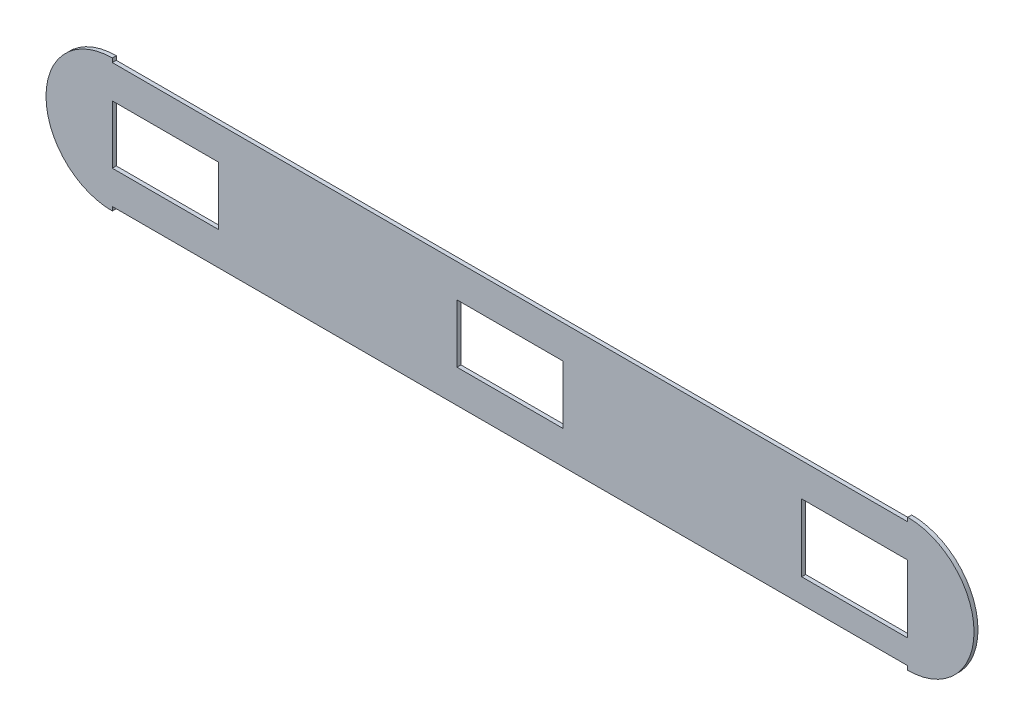
ISO-10303-21;
HEADER;
FILE_DESCRIPTION(('STEP AP214'),'2;1');
FILE_NAME('part.step','',(''),(''),'','','');
FILE_SCHEMA(('AUTOMOTIVE_DESIGN { 1 0 10303 214 1 1 1 1 }'));
ENDSEC;
DATA;
#1=APPLICATION_CONTEXT('core data for automotive mechanical design processes');
#2=APPLICATION_PROTOCOL_DEFINITION('international standard','automotive_design',2000,#1);
#3=PRODUCT_CONTEXT('',#1,'mechanical');
#4=PRODUCT('Part','Part','',(#3));
#5=PRODUCT_RELATED_PRODUCT_CATEGORY('part','',(#4));
#6=PRODUCT_DEFINITION_FORMATION('','',#4);
#7=PRODUCT_DEFINITION_CONTEXT('part definition',#1,'design');
#8=PRODUCT_DEFINITION('design','',#6,#7);
#9=PRODUCT_DEFINITION_SHAPE('','',#8);
#10=(LENGTH_UNIT() NAMED_UNIT(*) SI_UNIT(.MILLI.,.METRE.));
#11=(NAMED_UNIT(*) PLANE_ANGLE_UNIT() SI_UNIT($,.RADIAN.));
#12=(NAMED_UNIT(*) SI_UNIT($,.STERADIAN.) SOLID_ANGLE_UNIT());
#13=UNCERTAINTY_MEASURE_WITH_UNIT(LENGTH_MEASURE(1.E-05),#10,'distance_accuracy_value','');
#14=(GEOMETRIC_REPRESENTATION_CONTEXT(3) GLOBAL_UNCERTAINTY_ASSIGNED_CONTEXT((#13)) GLOBAL_UNIT_ASSIGNED_CONTEXT((#10,
#11,#12)) REPRESENTATION_CONTEXT('',''));
#15=CARTESIAN_POINT('',(0.,0.,0.));
#16=DIRECTION('',(0.,0.,1.));
#17=DIRECTION('',(1.,0.,0.));
#18=AXIS2_PLACEMENT_3D('',#15,#16,#17);
#19=CARTESIAN_POINT('',(-300.,0.,0.));
#20=DIRECTION('',(0.,0.,1.));
#21=DIRECTION('',(1.,0.,0.));
#22=AXIS2_PLACEMENT_3D('',#19,#20,#21);
#23=PLANE('',#22);
#24=DIRECTION('',(1.,0.,0.));
#25=VECTOR('',#24,1.);
#26=CARTESIAN_POINT('',(-300.,-28.9008568911611,0.));
#27=LINE('',#26,#25);
#28=CARTESIAN_POINT('',(220.,-28.900856891161,0.));
#29=VERTEX_POINT('',#28);
#30=CARTESIAN_POINT('',(300.,-28.900856891161,0.));
#31=VERTEX_POINT('',#30);
#32=EDGE_CURVE('E210',#29,#31,#27,.T.);
#33=ORIENTED_EDGE('',*,*,#32,.T.);
#34=DIRECTION('',(0.,1.,0.));
#35=VECTOR('',#34,1.);
#36=CARTESIAN_POINT('',(300.,0.,0.));
#37=LINE('',#36,#35);
#38=CARTESIAN_POINT('',(300.,22.,0.));
#39=VERTEX_POINT('',#38);
#40=EDGE_CURVE('E219',#31,#39,#37,.T.);
#41=ORIENTED_EDGE('',*,*,#40,.T.);
#42=DIRECTION('',(-1.,0.,0.));
#43=VECTOR('',#42,1.);
#44=CARTESIAN_POINT('',(-300.,22.,0.));
#45=LINE('',#44,#43);
#46=CARTESIAN_POINT('',(220.,22.,0.));
#47=VERTEX_POINT('',#46);
#48=EDGE_CURVE('E216',#39,#47,#45,.T.);
#49=ORIENTED_EDGE('',*,*,#48,.T.);
#50=DIRECTION('',(0.,-1.,0.));
#51=VECTOR('',#50,1.);
#52=CARTESIAN_POINT('',(220.,0.,0.));
#53=LINE('',#52,#51);
#54=EDGE_CURVE('E213',#47,#29,#53,.T.);
#55=ORIENTED_EDGE('',*,*,#54,.T.);
#56=EDGE_LOOP('',(#33,#41,#49,#55));
#57=FACE_BOUND('',#56,.T.);
#58=DIRECTION('',(-1.,0.,0.));
#59=VECTOR('',#58,1.);
#60=CARTESIAN_POINT('',(-300.,22.,0.));
#61=LINE('',#60,#59);
#62=CARTESIAN_POINT('',(-220.,22.,0.));
#63=VERTEX_POINT('',#62);
#64=CARTESIAN_POINT('',(-300.,22.,0.));
#65=VERTEX_POINT('',#64);
#66=EDGE_CURVE('E198',#63,#65,#61,.T.);
#67=ORIENTED_EDGE('',*,*,#66,.T.);
#68=DIRECTION('',(0.,-1.,0.));
#69=VECTOR('',#68,1.);
#70=CARTESIAN_POINT('',(-300.,0.,0.));
#71=LINE('',#70,#69);
#72=CARTESIAN_POINT('',(-300.,-22.,0.));
#73=VERTEX_POINT('',#72);
#74=EDGE_CURVE('E207',#65,#73,#71,.T.);
#75=ORIENTED_EDGE('',*,*,#74,.T.);
#76=DIRECTION('',(1.,0.,0.));
#77=VECTOR('',#76,1.);
#78=CARTESIAN_POINT('',(-300.,-22.,0.));
#79=LINE('',#78,#77);
#80=CARTESIAN_POINT('',(-220.,-22.0000000000001,0.));
#81=VERTEX_POINT('',#80);
#82=EDGE_CURVE('E204',#73,#81,#79,.T.);
#83=ORIENTED_EDGE('',*,*,#82,.T.);
#84=DIRECTION('',(0.,1.,0.));
#85=VECTOR('',#84,1.);
#86=CARTESIAN_POINT('',(-220.,0.,0.));
#87=LINE('',#86,#85);
#88=EDGE_CURVE('E201',#81,#63,#87,.T.);
#89=ORIENTED_EDGE('',*,*,#88,.T.);
#90=EDGE_LOOP('',(#67,#75,#83,#89));
#91=FACE_BOUND('',#90,.T.);
#92=DIRECTION('',(1.,0.,0.));
#93=VECTOR('',#92,1.);
#94=CARTESIAN_POINT('',(-300.,-22.,0.));
#95=LINE('',#94,#93);
#96=CARTESIAN_POINT('',(-40.0000000000001,-22.,0.));
#97=VERTEX_POINT('',#96);
#98=CARTESIAN_POINT('',(39.9999999999999,-22.,0.));
#99=VERTEX_POINT('',#98);
#100=EDGE_CURVE('E166',#97,#99,#95,.T.);
#101=ORIENTED_EDGE('',*,*,#100,.T.);
#102=DIRECTION('',(0.,1.,0.));
#103=VECTOR('',#102,1.);
#104=CARTESIAN_POINT('',(39.9999999999999,0.,0.));
#105=LINE('',#104,#103);
#106=CARTESIAN_POINT('',(39.9999999999999,22.,0.));
#107=VERTEX_POINT('',#106);
#108=EDGE_CURVE('E193',#99,#107,#105,.T.);
#109=ORIENTED_EDGE('',*,*,#108,.T.);
#110=DIRECTION('',(-1.,0.,0.));
#111=VECTOR('',#110,1.);
#112=CARTESIAN_POINT('',(-300.,22.,0.));
#113=LINE('',#112,#111);
#114=CARTESIAN_POINT('',(-40.0000000000001,22.,0.));
#115=VERTEX_POINT('',#114);
#116=EDGE_CURVE('E191',#107,#115,#113,.T.);
#117=ORIENTED_EDGE('',*,*,#116,.T.);
#118=DIRECTION('',(0.,-1.,0.));
#119=VECTOR('',#118,1.);
#120=CARTESIAN_POINT('',(-40.0000000000001,0.,0.));
#121=LINE('',#120,#119);
#122=EDGE_CURVE('E177',#115,#97,#121,.T.);
#123=ORIENTED_EDGE('',*,*,#122,.T.);
#124=EDGE_LOOP('',(#101,#109,#117,#123));
#125=FACE_BOUND('',#124,.T.);
#126=DIRECTION('',(1.,0.,0.));
#127=VECTOR('',#126,1.);
#128=CARTESIAN_POINT('',(-300.,47.,0.));
#129=LINE('',#128,#127);
#130=CARTESIAN_POINT('',(-300.,47.,0.));
#131=VERTEX_POINT('',#130);
#132=CARTESIAN_POINT('',(300.,47.,0.));
#133=VERTEX_POINT('',#132);
#134=EDGE_CURVE('E265',#131,#133,#129,.T.);
#135=ORIENTED_EDGE('',*,*,#134,.T.);
#136=DIRECTION('',(0.,-1.,0.));
#137=VECTOR('',#136,1.);
#138=CARTESIAN_POINT('',(300.,3.43367945760358E-13,0.));
#139=LINE('',#138,#137);
#140=CARTESIAN_POINT('',(300.,50.,0.));
#141=VERTEX_POINT('',#140);
#142=EDGE_CURVE('E225',#141,#133,#139,.T.);
#143=ORIENTED_EDGE('',*,*,#142,.F.);
#144=CARTESIAN_POINT('',(300.,0.,0.));
#145=DIRECTION('',(0.,0.,1.));
#146=DIRECTION('',(1.,0.,0.));
#147=AXIS2_PLACEMENT_3D('',#144,#145,#146);
#148=CIRCLE('',#147,50.);
#149=CARTESIAN_POINT('',(300.,-50.,0.));
#150=VERTEX_POINT('',#149);
#151=EDGE_CURVE('E229',#150,#141,#148,.T.);
#152=ORIENTED_EDGE('',*,*,#151,.F.);
#153=CARTESIAN_POINT('',(300.,-47.,0.));
#154=VERTEX_POINT('',#153);
#155=EDGE_CURVE('E234',#154,#150,#139,.T.);
#156=ORIENTED_EDGE('',*,*,#155,.F.);
#157=DIRECTION('',(-1.,0.,0.));
#158=VECTOR('',#157,1.);
#159=CARTESIAN_POINT('',(-300.,-47.,0.));
#160=LINE('',#159,#158);
#161=CARTESIAN_POINT('',(-300.,-47.,0.));
#162=VERTEX_POINT('',#161);
#163=EDGE_CURVE('E261',#154,#162,#160,.T.);
#164=ORIENTED_EDGE('',*,*,#163,.T.);
#165=DIRECTION('',(0.,-1.,0.));
#166=VECTOR('',#165,1.);
#167=CARTESIAN_POINT('',(-300.,0.,0.));
#168=LINE('',#167,#166);
#169=CARTESIAN_POINT('',(-300.,-50.,0.));
#170=VERTEX_POINT('',#169);
#171=EDGE_CURVE('E253',#162,#170,#168,.T.);
#172=ORIENTED_EDGE('',*,*,#171,.T.);
#173=CARTESIAN_POINT('',(-300.,0.,0.));
#174=DIRECTION('',(0.,0.,1.));
#175=DIRECTION('',(1.,0.,0.));
#176=AXIS2_PLACEMENT_3D('',#173,#174,#175);
#177=CIRCLE('',#176,50.);
#178=CARTESIAN_POINT('',(-300.,50.,0.));
#179=VERTEX_POINT('',#178);
#180=EDGE_CURVE('E241',#179,#170,#177,.T.);
#181=ORIENTED_EDGE('',*,*,#180,.F.);
#182=EDGE_CURVE('E258',#179,#131,#168,.T.);
#183=ORIENTED_EDGE('',*,*,#182,.T.);
#184=EDGE_LOOP('',(#135,#143,#152,#156,#164,#172,#181,#183));
#185=FACE_BOUND('',#184,.T.);
#186=ADVANCED_FACE('F32',(#57,#91,#125,#185),#23,.F.);
#187=CARTESIAN_POINT('',(-300.,0.,3.));
#188=DIRECTION('',(0.,0.,1.));
#189=DIRECTION('',(1.,0.,0.));
#190=AXIS2_PLACEMENT_3D('',#187,#188,#189);
#191=PLANE('',#190);
#192=DIRECTION('',(0.,1.,0.));
#193=VECTOR('',#192,1.);
#194=CARTESIAN_POINT('',(300.,0.,3.));
#195=LINE('',#194,#193);
#196=CARTESIAN_POINT('',(300.,-28.900856891161,3.));
#197=VERTEX_POINT('',#196);
#198=CARTESIAN_POINT('',(300.,22.,3.));
#199=VERTEX_POINT('',#198);
#200=EDGE_CURVE('E11',#197,#199,#195,.T.);
#201=ORIENTED_EDGE('',*,*,#200,.F.);
#202=DIRECTION('',(1.,0.,0.));
#203=VECTOR('',#202,1.);
#204=CARTESIAN_POINT('',(-300.,-28.9008568911611,3.));
#205=LINE('',#204,#203);
#206=CARTESIAN_POINT('',(220.,-28.900856891161,3.));
#207=VERTEX_POINT('',#206);
#208=EDGE_CURVE('E298',#207,#197,#205,.T.);
#209=ORIENTED_EDGE('',*,*,#208,.F.);
#210=DIRECTION('',(0.,-1.,0.));
#211=VECTOR('',#210,1.);
#212=CARTESIAN_POINT('',(220.,0.,3.));
#213=LINE('',#212,#211);
#214=CARTESIAN_POINT('',(220.,22.,3.));
#215=VERTEX_POINT('',#214);
#216=EDGE_CURVE('E300',#215,#207,#213,.T.);
#217=ORIENTED_EDGE('',*,*,#216,.F.);
#218=DIRECTION('',(-1.,0.,0.));
#219=VECTOR('',#218,1.);
#220=CARTESIAN_POINT('',(-300.,22.,3.));
#221=LINE('',#220,#219);
#222=EDGE_CURVE('E39',#199,#215,#221,.T.);
#223=ORIENTED_EDGE('',*,*,#222,.F.);
#224=EDGE_LOOP('',(#201,#209,#217,#223));
#225=FACE_BOUND('',#224,.T.);
#226=DIRECTION('',(0.,-1.,0.));
#227=VECTOR('',#226,1.);
#228=CARTESIAN_POINT('',(-300.,0.,3.));
#229=LINE('',#228,#227);
#230=CARTESIAN_POINT('',(-300.,22.,3.));
#231=VERTEX_POINT('',#230);
#232=CARTESIAN_POINT('',(-300.,-22.,3.));
#233=VERTEX_POINT('',#232);
#234=EDGE_CURVE('E296',#231,#233,#229,.T.);
#235=ORIENTED_EDGE('',*,*,#234,.F.);
#236=DIRECTION('',(-1.,0.,0.));
#237=VECTOR('',#236,1.);
#238=CARTESIAN_POINT('',(-300.,22.,3.));
#239=LINE('',#238,#237);
#240=CARTESIAN_POINT('',(-220.,22.,3.));
#241=VERTEX_POINT('',#240);
#242=EDGE_CURVE('E289',#241,#231,#239,.T.);
#243=ORIENTED_EDGE('',*,*,#242,.F.);
#244=DIRECTION('',(0.,1.,0.));
#245=VECTOR('',#244,1.);
#246=CARTESIAN_POINT('',(-220.,0.,3.));
#247=LINE('',#246,#245);
#248=CARTESIAN_POINT('',(-220.,-22.0000000000001,3.));
#249=VERTEX_POINT('',#248);
#250=EDGE_CURVE('E291',#249,#241,#247,.T.);
#251=ORIENTED_EDGE('',*,*,#250,.F.);
#252=DIRECTION('',(1.,0.,0.));
#253=VECTOR('',#252,1.);
#254=CARTESIAN_POINT('',(-300.,-22.,3.));
#255=LINE('',#254,#253);
#256=EDGE_CURVE('E294',#233,#249,#255,.T.);
#257=ORIENTED_EDGE('',*,*,#256,.F.);
#258=EDGE_LOOP('',(#235,#243,#251,#257));
#259=FACE_BOUND('',#258,.T.);
#260=DIRECTION('',(0.,1.,0.));
#261=VECTOR('',#260,1.);
#262=CARTESIAN_POINT('',(39.9999999999999,0.,3.));
#263=LINE('',#262,#261);
#264=CARTESIAN_POINT('',(39.9999999999999,-22.,3.));
#265=VERTEX_POINT('',#264);
#266=CARTESIAN_POINT('',(39.9999999999999,22.,3.));
#267=VERTEX_POINT('',#266);
#268=EDGE_CURVE('E287',#265,#267,#263,.T.);
#269=ORIENTED_EDGE('',*,*,#268,.F.);
#270=DIRECTION('',(1.,0.,0.));
#271=VECTOR('',#270,1.);
#272=CARTESIAN_POINT('',(-300.,-22.,3.));
#273=LINE('',#272,#271);
#274=CARTESIAN_POINT('',(-40.0000000000001,-22.,3.));
#275=VERTEX_POINT('',#274);
#276=EDGE_CURVE('E264',#275,#265,#273,.T.);
#277=ORIENTED_EDGE('',*,*,#276,.F.);
#278=DIRECTION('',(0.,-1.,0.));
#279=VECTOR('',#278,1.);
#280=CARTESIAN_POINT('',(-40.0000000000001,0.,3.));
#281=LINE('',#280,#279);
#282=CARTESIAN_POINT('',(-40.0000000000001,22.,3.));
#283=VERTEX_POINT('',#282);
#284=EDGE_CURVE('E185',#283,#275,#281,.T.);
#285=ORIENTED_EDGE('',*,*,#284,.F.);
#286=DIRECTION('',(-1.,0.,0.));
#287=VECTOR('',#286,1.);
#288=CARTESIAN_POINT('',(-300.,22.,3.));
#289=LINE('',#288,#287);
#290=EDGE_CURVE('E285',#267,#283,#289,.T.);
#291=ORIENTED_EDGE('',*,*,#290,.F.);
#292=EDGE_LOOP('',(#269,#277,#285,#291));
#293=FACE_BOUND('',#292,.T.);
#294=DIRECTION('',(1.,0.,0.));
#295=VECTOR('',#294,1.);
#296=CARTESIAN_POINT('',(-300.,-47.,3.));
#297=LINE('',#296,#295);
#298=CARTESIAN_POINT('',(-300.,-47.,3.));
#299=VERTEX_POINT('',#298);
#300=CARTESIAN_POINT('',(300.,-47.,3.));
#301=VERTEX_POINT('',#300);
#302=EDGE_CURVE('E271',#299,#301,#297,.T.);
#303=ORIENTED_EDGE('',*,*,#302,.T.);
#304=DIRECTION('',(0.,1.,0.));
#305=VECTOR('',#304,1.);
#306=CARTESIAN_POINT('',(300.,1.71683972880179E-13,3.));
#307=LINE('',#306,#305);
#308=CARTESIAN_POINT('',(300.,-50.,3.));
#309=VERTEX_POINT('',#308);
#310=EDGE_CURVE('E235',#309,#301,#307,.T.);
#311=ORIENTED_EDGE('',*,*,#310,.F.);
#312=CARTESIAN_POINT('',(300.,0.,3.));
#313=DIRECTION('',(0.,0.,1.));
#314=DIRECTION('',(1.,0.,0.));
#315=AXIS2_PLACEMENT_3D('',#312,#313,#314);
#316=CIRCLE('',#315,50.);
#317=CARTESIAN_POINT('',(300.,50.,3.));
#318=VERTEX_POINT('',#317);
#319=EDGE_CURVE('E222',#309,#318,#316,.T.);
#320=ORIENTED_EDGE('',*,*,#319,.T.);
#321=DIRECTION('',(0.,1.,0.));
#322=VECTOR('',#321,1.);
#323=CARTESIAN_POINT('',(300.,1.71683972880179E-13,3.));
#324=LINE('',#323,#322);
#325=CARTESIAN_POINT('',(300.,47.,3.));
#326=VERTEX_POINT('',#325);
#327=EDGE_CURVE('E226',#326,#318,#324,.T.);
#328=ORIENTED_EDGE('',*,*,#327,.F.);
#329=DIRECTION('',(-1.,0.,0.));
#330=VECTOR('',#329,1.);
#331=CARTESIAN_POINT('',(300.,47.,3.));
#332=LINE('',#331,#330);
#333=CARTESIAN_POINT('',(-300.,47.,3.));
#334=VERTEX_POINT('',#333);
#335=EDGE_CURVE('E268',#326,#334,#332,.T.);
#336=ORIENTED_EDGE('',*,*,#335,.T.);
#337=DIRECTION('',(0.,-1.,0.));
#338=VECTOR('',#337,1.);
#339=CARTESIAN_POINT('',(-300.,0.,3.));
#340=LINE('',#339,#338);
#341=CARTESIAN_POINT('',(-300.,50.,3.));
#342=VERTEX_POINT('',#341);
#343=EDGE_CURVE('E254',#342,#334,#340,.T.);
#344=ORIENTED_EDGE('',*,*,#343,.F.);
#345=CARTESIAN_POINT('',(-300.,0.,3.));
#346=DIRECTION('',(0.,0.,1.));
#347=DIRECTION('',(1.,0.,0.));
#348=AXIS2_PLACEMENT_3D('',#345,#346,#347);
#349=CIRCLE('',#348,50.);
#350=CARTESIAN_POINT('',(-300.,-50.,3.));
#351=VERTEX_POINT('',#350);
#352=EDGE_CURVE('E245',#342,#351,#349,.T.);
#353=ORIENTED_EDGE('',*,*,#352,.T.);
#354=EDGE_CURVE('E257',#299,#351,#340,.T.);
#355=ORIENTED_EDGE('',*,*,#354,.F.);
#356=EDGE_LOOP('',(#303,#311,#320,#328,#336,#344,#353,#355));
#357=FACE_BOUND('',#356,.T.);
#358=ADVANCED_FACE('F319',(#225,#259,#293,#357),#191,.T.);
#359=CARTESIAN_POINT('',(300.,-47.,60.01));
#360=DIRECTION('',(0.,-1.,0.));
#361=DIRECTION('',(0.,0.,-1.));
#362=AXIS2_PLACEMENT_3D('',#359,#360,#361);
#363=PLANE('',#362);
#364=ORIENTED_EDGE('',*,*,#302,.F.);
#365=DIRECTION('',(0.,0.,-1.));
#366=VECTOR('',#365,1.);
#367=CARTESIAN_POINT('',(-300.,-47.,60.01));
#368=LINE('',#367,#366);
#369=EDGE_CURVE('E277',#299,#162,#368,.T.);
#370=ORIENTED_EDGE('',*,*,#369,.T.);
#371=ORIENTED_EDGE('',*,*,#163,.F.);
#372=DIRECTION('',(0.,0.,-1.));
#373=VECTOR('',#372,1.);
#374=CARTESIAN_POINT('',(300.,-47.,60.01));
#375=LINE('',#374,#373);
#376=EDGE_CURVE('E280',#301,#154,#375,.T.);
#377=ORIENTED_EDGE('',*,*,#376,.F.);
#378=EDGE_LOOP('',(#364,#370,#371,#377));
#379=FACE_BOUND('',#378,.T.);
#380=ADVANCED_FACE('F371',(#379),#363,.T.);
#381=CARTESIAN_POINT('',(-300.,47.,60.01));
#382=DIRECTION('',(0.,1.,0.));
#383=DIRECTION('',(0.,0.,1.));
#384=AXIS2_PLACEMENT_3D('',#381,#382,#383);
#385=PLANE('',#384);
#386=ORIENTED_EDGE('',*,*,#335,.F.);
#387=DIRECTION('',(0.,0.,-1.));
#388=VECTOR('',#387,1.);
#389=CARTESIAN_POINT('',(300.,47.,60.01));
#390=LINE('',#389,#388);
#391=EDGE_CURVE('E274',#326,#133,#390,.T.);
#392=ORIENTED_EDGE('',*,*,#391,.T.);
#393=ORIENTED_EDGE('',*,*,#134,.F.);
#394=DIRECTION('',(0.,0.,-1.));
#395=VECTOR('',#394,1.);
#396=CARTESIAN_POINT('',(-300.,47.,60.01));
#397=LINE('',#396,#395);
#398=EDGE_CURVE('E256',#334,#131,#397,.T.);
#399=ORIENTED_EDGE('',*,*,#398,.F.);
#400=EDGE_LOOP('',(#386,#392,#393,#399));
#401=FACE_BOUND('',#400,.T.);
#402=ADVANCED_FACE('F372',(#401),#385,.T.);
#403=CARTESIAN_POINT('',(-300.,0.,0.));
#404=DIRECTION('',(-1.,0.,0.));
#405=DIRECTION('',(0.,0.,1.));
#406=AXIS2_PLACEMENT_3D('',#403,#404,#405);
#407=PLANE('',#406);
#408=ORIENTED_EDGE('',*,*,#343,.T.);
#409=ORIENTED_EDGE('',*,*,#398,.T.);
#410=ORIENTED_EDGE('',*,*,#182,.F.);
#411=DIRECTION('',(0.,0.,-1.));
#412=VECTOR('',#411,1.);
#413=CARTESIAN_POINT('',(-300.,50.,60.));
#414=LINE('',#413,#412);
#415=EDGE_CURVE('E244',#342,#179,#414,.T.);
#416=ORIENTED_EDGE('',*,*,#415,.F.);
#417=EDGE_LOOP('',(#408,#409,#410,#416));
#418=FACE_BOUND('',#417,.T.);
#419=ADVANCED_FACE('F472',(#418),#407,.F.);
#420=ORIENTED_EDGE('',*,*,#369,.F.);
#421=ORIENTED_EDGE('',*,*,#354,.T.);
#422=DIRECTION('',(0.,0.,-1.));
#423=VECTOR('',#422,1.);
#424=CARTESIAN_POINT('',(-300.,-50.,60.));
#425=LINE('',#424,#423);
#426=EDGE_CURVE('E250',#351,#170,#425,.T.);
#427=ORIENTED_EDGE('',*,*,#426,.T.);
#428=ORIENTED_EDGE('',*,*,#171,.F.);
#429=EDGE_LOOP('',(#420,#421,#427,#428));
#430=FACE_BOUND('',#429,.T.);
#431=ADVANCED_FACE('F464',(#430),#407,.F.);
#432=CARTESIAN_POINT('',(-300.,0.,60.));
#433=DIRECTION('',(0.,0.,-1.));
#434=DIRECTION('',(-1.,0.,0.));
#435=AXIS2_PLACEMENT_3D('',#432,#433,#434);
#436=CYLINDRICAL_SURFACE('',#435,50.);
#437=ORIENTED_EDGE('',*,*,#352,.F.);
#438=ORIENTED_EDGE('',*,*,#415,.T.);
#439=ORIENTED_EDGE('',*,*,#180,.T.);
#440=ORIENTED_EDGE('',*,*,#426,.F.);
#441=EDGE_LOOP('',(#437,#438,#439,#440));
#442=FACE_BOUND('',#441,.T.);
#443=ADVANCED_FACE('F451',(#442),#436,.T.);
#444=CARTESIAN_POINT('',(300.,0.,60.));
#445=DIRECTION('',(0.,0.,-1.));
#446=DIRECTION('',(-1.,0.,0.));
#447=AXIS2_PLACEMENT_3D('',#444,#445,#446);
#448=CYLINDRICAL_SURFACE('',#447,50.);
#449=ORIENTED_EDGE('',*,*,#319,.F.);
#450=DIRECTION('',(0.,0.,-1.));
#451=VECTOR('',#450,1.);
#452=CARTESIAN_POINT('',(300.,-50.,60.));
#453=LINE('',#452,#451);
#454=EDGE_CURVE('E227',#309,#150,#453,.T.);
#455=ORIENTED_EDGE('',*,*,#454,.T.);
#456=ORIENTED_EDGE('',*,*,#151,.T.);
#457=DIRECTION('',(0.,0.,-1.));
#458=VECTOR('',#457,1.);
#459=CARTESIAN_POINT('',(300.,50.,60.));
#460=LINE('',#459,#458);
#461=EDGE_CURVE('E223',#318,#141,#460,.T.);
#462=ORIENTED_EDGE('',*,*,#461,.F.);
#463=EDGE_LOOP('',(#449,#455,#456,#462));
#464=FACE_BOUND('',#463,.T.);
#465=ADVANCED_FACE('F361',(#464),#448,.T.);
#466=CARTESIAN_POINT('',(300.,1.71683972880179E-13,0.));
#467=DIRECTION('',(-1.,0.,0.));
#468=DIRECTION('',(0.,-1.,0.));
#469=AXIS2_PLACEMENT_3D('',#466,#467,#468);
#470=PLANE('',#469);
#471=ORIENTED_EDGE('',*,*,#454,.F.);
#472=ORIENTED_EDGE('',*,*,#310,.T.);
#473=ORIENTED_EDGE('',*,*,#376,.T.);
#474=ORIENTED_EDGE('',*,*,#155,.T.);
#475=EDGE_LOOP('',(#471,#472,#473,#474));
#476=FACE_BOUND('',#475,.T.);
#477=ADVANCED_FACE('F358',(#476),#470,.T.);
#478=ORIENTED_EDGE('',*,*,#391,.F.);
#479=ORIENTED_EDGE('',*,*,#327,.T.);
#480=ORIENTED_EDGE('',*,*,#461,.T.);
#481=ORIENTED_EDGE('',*,*,#142,.T.);
#482=EDGE_LOOP('',(#478,#479,#480,#481));
#483=FACE_BOUND('',#482,.T.);
#484=ADVANCED_FACE('F350',(#483),#470,.T.);
#485=CARTESIAN_POINT('',(39.9999999999999,22.,60.));
#486=DIRECTION('',(1.,0.,0.));
#487=DIRECTION('',(0.,1.,0.));
#488=AXIS2_PLACEMENT_3D('',#485,#486,#487);
#489=PLANE('',#488);
#490=DIRECTION('',(0.,0.,-1.));
#491=VECTOR('',#490,1.);
#492=CARTESIAN_POINT('',(39.9999999999999,-22.,60.));
#493=LINE('',#492,#491);
#494=EDGE_CURVE('E172',#265,#99,#493,.T.);
#495=ORIENTED_EDGE('',*,*,#494,.F.);
#496=ORIENTED_EDGE('',*,*,#268,.T.);
#497=DIRECTION('',(0.,0.,-1.));
#498=VECTOR('',#497,1.);
#499=CARTESIAN_POINT('',(39.9999999999999,22.,60.));
#500=LINE('',#499,#498);
#501=EDGE_CURVE('E337',#267,#107,#500,.T.);
#502=ORIENTED_EDGE('',*,*,#501,.T.);
#503=ORIENTED_EDGE('',*,*,#108,.F.);
#504=EDGE_LOOP('',(#495,#496,#502,#503));
#505=FACE_BOUND('',#504,.T.);
#506=ADVANCED_FACE('F348',(#505),#489,.F.);
#507=CARTESIAN_POINT('',(39.9999999999999,22.,60.));
#508=DIRECTION('',(0.,1.,0.));
#509=DIRECTION('',(0.,0.,1.));
#510=AXIS2_PLACEMENT_3D('',#507,#508,#509);
#511=PLANE('',#510);
#512=ORIENTED_EDGE('',*,*,#501,.F.);
#513=ORIENTED_EDGE('',*,*,#290,.T.);
#514=DIRECTION('',(0.,0.,-1.));
#515=VECTOR('',#514,1.);
#516=CARTESIAN_POINT('',(-40.0000000000001,22.,60.));
#517=LINE('',#516,#515);
#518=EDGE_CURVE('E187',#283,#115,#517,.T.);
#519=ORIENTED_EDGE('',*,*,#518,.T.);
#520=ORIENTED_EDGE('',*,*,#116,.F.);
#521=EDGE_LOOP('',(#512,#513,#519,#520));
#522=FACE_BOUND('',#521,.T.);
#523=ADVANCED_FACE('F342',(#522),#511,.F.);
#524=CARTESIAN_POINT('',(-40.0000000000001,22.,60.));
#525=DIRECTION('',(-1.,0.,0.));
#526=DIRECTION('',(0.,-1.,0.));
#527=AXIS2_PLACEMENT_3D('',#524,#525,#526);
#528=PLANE('',#527);
#529=ORIENTED_EDGE('',*,*,#518,.F.);
#530=ORIENTED_EDGE('',*,*,#284,.T.);
#531=DIRECTION('',(0.,0.,-1.));
#532=VECTOR('',#531,1.);
#533=CARTESIAN_POINT('',(-40.0000000000001,-22.,60.));
#534=LINE('',#533,#532);
#535=EDGE_CURVE('E169',#275,#97,#534,.T.);
#536=ORIENTED_EDGE('',*,*,#535,.T.);
#537=ORIENTED_EDGE('',*,*,#122,.F.);
#538=EDGE_LOOP('',(#529,#530,#536,#537));
#539=FACE_BOUND('',#538,.T.);
#540=ADVANCED_FACE('F182',(#539),#528,.F.);
#541=CARTESIAN_POINT('',(39.9999999999999,-22.,60.));
#542=DIRECTION('',(0.,-1.,0.));
#543=DIRECTION('',(0.,0.,-1.));
#544=AXIS2_PLACEMENT_3D('',#541,#542,#543);
#545=PLANE('',#544);
#546=ORIENTED_EDGE('',*,*,#535,.F.);
#547=ORIENTED_EDGE('',*,*,#276,.T.);
#548=ORIENTED_EDGE('',*,*,#494,.T.);
#549=ORIENTED_EDGE('',*,*,#100,.F.);
#550=EDGE_LOOP('',(#546,#547,#548,#549));
#551=FACE_BOUND('',#550,.T.);
#552=ADVANCED_FACE('F168',(#551),#545,.F.);
#553=CARTESIAN_POINT('',(-300.,-22.,60.));
#554=DIRECTION('',(-1.,0.,0.));
#555=DIRECTION('',(0.,0.,1.));
#556=AXIS2_PLACEMENT_3D('',#553,#554,#555);
#557=PLANE('',#556);
#558=DIRECTION('',(0.,0.,-1.));
#559=VECTOR('',#558,1.);
#560=CARTESIAN_POINT('',(-300.,22.,60.));
#561=LINE('',#560,#559);
#562=EDGE_CURVE('E54',#231,#65,#561,.T.);
#563=ORIENTED_EDGE('',*,*,#562,.F.);
#564=ORIENTED_EDGE('',*,*,#234,.T.);
#565=DIRECTION('',(0.,0.,-1.));
#566=VECTOR('',#565,1.);
#567=CARTESIAN_POINT('',(-300.,-22.,60.));
#568=LINE('',#567,#566);
#569=EDGE_CURVE('E324',#233,#73,#568,.T.);
#570=ORIENTED_EDGE('',*,*,#569,.T.);
#571=ORIENTED_EDGE('',*,*,#74,.F.);
#572=EDGE_LOOP('',(#563,#564,#570,#571));
#573=FACE_BOUND('',#572,.T.);
#574=ADVANCED_FACE('F383',(#573),#557,.F.);
#575=CARTESIAN_POINT('',(-300.,-22.,60.));
#576=DIRECTION('',(0.,-1.,0.));
#577=DIRECTION('',(1.,0.,0.));
#578=AXIS2_PLACEMENT_3D('',#575,#576,#577);
#579=PLANE('',#578);
#580=ORIENTED_EDGE('',*,*,#569,.F.);
#581=ORIENTED_EDGE('',*,*,#256,.T.);
#582=DIRECTION('',(0.,0.,-1.));
#583=VECTOR('',#582,1.);
#584=CARTESIAN_POINT('',(-220.,-22.0000000000001,60.));
#585=LINE('',#584,#583);
#586=EDGE_CURVE('E328',#249,#81,#585,.T.);
#587=ORIENTED_EDGE('',*,*,#586,.T.);
#588=ORIENTED_EDGE('',*,*,#82,.F.);
#589=EDGE_LOOP('',(#580,#581,#587,#588));
#590=FACE_BOUND('',#589,.T.);
#591=ADVANCED_FACE('F386',(#590),#579,.F.);
#592=CARTESIAN_POINT('',(-220.,-22.0000000000001,60.));
#593=DIRECTION('',(1.,0.,0.));
#594=DIRECTION('',(0.,0.,-1.));
#595=AXIS2_PLACEMENT_3D('',#592,#593,#594);
#596=PLANE('',#595);
#597=ORIENTED_EDGE('',*,*,#586,.F.);
#598=ORIENTED_EDGE('',*,*,#250,.T.);
#599=DIRECTION('',(0.,0.,-1.));
#600=VECTOR('',#599,1.);
#601=CARTESIAN_POINT('',(-220.,22.,60.));
#602=LINE('',#601,#600);
#603=EDGE_CURVE('E333',#241,#63,#602,.T.);
#604=ORIENTED_EDGE('',*,*,#603,.T.);
#605=ORIENTED_EDGE('',*,*,#88,.F.);
#606=EDGE_LOOP('',(#597,#598,#604,#605));
#607=FACE_BOUND('',#606,.T.);
#608=ADVANCED_FACE('F377',(#607),#596,.F.);
#609=CARTESIAN_POINT('',(-300.,22.,60.));
#610=DIRECTION('',(0.,1.,0.));
#611=DIRECTION('',(-1.,0.,0.));
#612=AXIS2_PLACEMENT_3D('',#609,#610,#611);
#613=PLANE('',#612);
#614=ORIENTED_EDGE('',*,*,#603,.F.);
#615=ORIENTED_EDGE('',*,*,#242,.T.);
#616=ORIENTED_EDGE('',*,*,#562,.T.);
#617=ORIENTED_EDGE('',*,*,#66,.F.);
#618=EDGE_LOOP('',(#614,#615,#616,#617));
#619=FACE_BOUND('',#618,.T.);
#620=ADVANCED_FACE('F374',(#619),#613,.F.);
#621=CARTESIAN_POINT('',(300.,-28.900856891161,60.));
#622=DIRECTION('',(1.,0.,0.));
#623=DIRECTION('',(0.,0.,-1.));
#624=AXIS2_PLACEMENT_3D('',#621,#622,#623);
#625=PLANE('',#624);
#626=DIRECTION('',(0.,0.,-1.));
#627=VECTOR('',#626,1.);
#628=CARTESIAN_POINT('',(300.,-28.900856891161,60.));
#629=LINE('',#628,#627);
#630=EDGE_CURVE('E46',#197,#31,#629,.T.);
#631=ORIENTED_EDGE('',*,*,#630,.F.);
#632=ORIENTED_EDGE('',*,*,#200,.T.);
#633=DIRECTION('',(0.,0.,-1.));
#634=VECTOR('',#633,1.);
#635=CARTESIAN_POINT('',(300.,22.,60.));
#636=LINE('',#635,#634);
#637=EDGE_CURVE('E178',#199,#39,#636,.T.);
#638=ORIENTED_EDGE('',*,*,#637,.T.);
#639=ORIENTED_EDGE('',*,*,#40,.F.);
#640=EDGE_LOOP('',(#631,#632,#638,#639));
#641=FACE_BOUND('',#640,.T.);
#642=ADVANCED_FACE('F323',(#641),#625,.F.);
#643=CARTESIAN_POINT('',(300.,22.,60.));
#644=DIRECTION('',(0.,1.,0.));
#645=DIRECTION('',(0.,0.,1.));
#646=AXIS2_PLACEMENT_3D('',#643,#644,#645);
#647=PLANE('',#646);
#648=ORIENTED_EDGE('',*,*,#637,.F.);
#649=ORIENTED_EDGE('',*,*,#222,.T.);
#650=DIRECTION('',(0.,0.,-1.));
#651=VECTOR('',#650,1.);
#652=CARTESIAN_POINT('',(220.,22.,60.));
#653=LINE('',#652,#651);
#654=EDGE_CURVE('E308',#215,#47,#653,.T.);
#655=ORIENTED_EDGE('',*,*,#654,.T.);
#656=ORIENTED_EDGE('',*,*,#48,.F.);
#657=EDGE_LOOP('',(#648,#649,#655,#656));
#658=FACE_BOUND('',#657,.T.);
#659=ADVANCED_FACE('F307',(#658),#647,.F.);
#660=CARTESIAN_POINT('',(220.,-28.900856891161,60.));
#661=DIRECTION('',(-1.,0.,0.));
#662=DIRECTION('',(0.,0.,1.));
#663=AXIS2_PLACEMENT_3D('',#660,#661,#662);
#664=PLANE('',#663);
#665=ORIENTED_EDGE('',*,*,#654,.F.);
#666=ORIENTED_EDGE('',*,*,#216,.T.);
#667=DIRECTION('',(0.,0.,-1.));
#668=VECTOR('',#667,1.);
#669=CARTESIAN_POINT('',(220.,-28.900856891161,60.));
#670=LINE('',#669,#668);
#671=EDGE_CURVE('E317',#207,#29,#670,.T.);
#672=ORIENTED_EDGE('',*,*,#671,.T.);
#673=ORIENTED_EDGE('',*,*,#54,.F.);
#674=EDGE_LOOP('',(#665,#666,#672,#673));
#675=FACE_BOUND('',#674,.T.);
#676=ADVANCED_FACE('F314',(#675),#664,.F.);
#677=CARTESIAN_POINT('',(300.,-28.900856891161,60.));
#678=DIRECTION('',(0.,-1.,0.));
#679=DIRECTION('',(1.,0.,0.));
#680=AXIS2_PLACEMENT_3D('',#677,#678,#679);
#681=PLANE('',#680);
#682=ORIENTED_EDGE('',*,*,#671,.F.);
#683=ORIENTED_EDGE('',*,*,#208,.T.);
#684=ORIENTED_EDGE('',*,*,#630,.T.);
#685=ORIENTED_EDGE('',*,*,#32,.F.);
#686=EDGE_LOOP('',(#682,#683,#684,#685));
#687=FACE_BOUND('',#686,.T.);
#688=ADVANCED_FACE('F321',(#687),#681,.F.);
#689=CLOSED_SHELL('',(#186,#358,#380,#402,#419,#431,#443,#465,#477,#484,#506,#523,#540,#552,
#574,#591,#608,#620,#642,#659,#676,#688));
#690=MANIFOLD_SOLID_BREP('B2',#689);
#691=ADVANCED_BREP_SHAPE_REPRESENTATION('',(#18,#690),#14);
#692=SHAPE_DEFINITION_REPRESENTATION(#9,#691);
ENDSEC;
END-ISO-10303-21;
